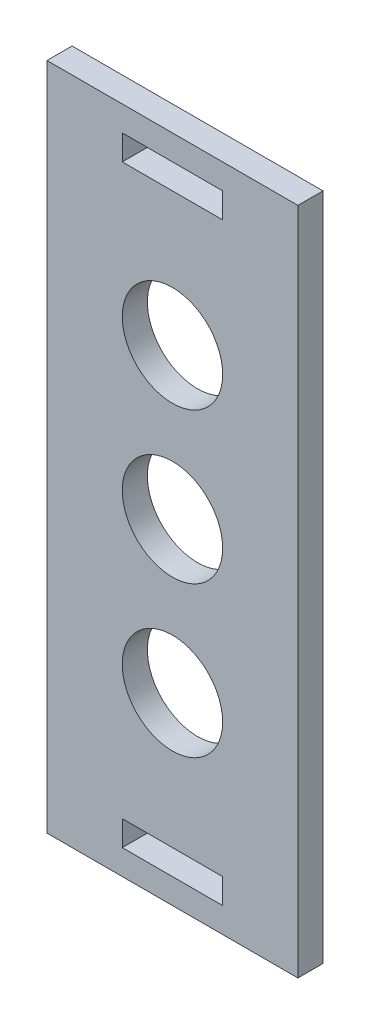
ISO-10303-21;
HEADER;
FILE_DESCRIPTION(('STEP AP214'),'2;1');
FILE_NAME('part.step','',(''),(''),'','','');
FILE_SCHEMA(('AUTOMOTIVE_DESIGN { 1 0 10303 214 1 1 1 1 }'));
ENDSEC;
DATA;
#1=APPLICATION_CONTEXT('core data for automotive mechanical design processes');
#2=APPLICATION_PROTOCOL_DEFINITION('international standard','automotive_design',2000,#1);
#3=PRODUCT_CONTEXT('',#1,'mechanical');
#4=PRODUCT('Part','Part','',(#3));
#5=PRODUCT_RELATED_PRODUCT_CATEGORY('part','',(#4));
#6=PRODUCT_DEFINITION_FORMATION('','',#4);
#7=PRODUCT_DEFINITION_CONTEXT('part definition',#1,'design');
#8=PRODUCT_DEFINITION('design','',#6,#7);
#9=PRODUCT_DEFINITION_SHAPE('','',#8);
#10=(LENGTH_UNIT() NAMED_UNIT(*) SI_UNIT(.MILLI.,.METRE.));
#11=(NAMED_UNIT(*) PLANE_ANGLE_UNIT() SI_UNIT($,.RADIAN.));
#12=(NAMED_UNIT(*) SI_UNIT($,.STERADIAN.) SOLID_ANGLE_UNIT());
#13=UNCERTAINTY_MEASURE_WITH_UNIT(LENGTH_MEASURE(1.E-05),#10,'distance_accuracy_value','');
#14=(GEOMETRIC_REPRESENTATION_CONTEXT(3) GLOBAL_UNCERTAINTY_ASSIGNED_CONTEXT((#13)) GLOBAL_UNIT_ASSIGNED_CONTEXT((#10,
#11,#12)) REPRESENTATION_CONTEXT('',''));
#15=CARTESIAN_POINT('',(0.,0.,0.));
#16=DIRECTION('',(0.,0.,1.));
#17=DIRECTION('',(1.,0.,0.));
#18=AXIS2_PLACEMENT_3D('',#15,#16,#17);
#19=CARTESIAN_POINT('',(0.,0.,3.));
#20=DIRECTION('',(0.,0.,-1.));
#21=DIRECTION('',(-1.,0.,0.));
#22=AXIS2_PLACEMENT_3D('',#19,#20,#21);
#23=PLANE('',#22);
#24=DIRECTION('',(0.,-1.,0.));
#25=VECTOR('',#24,1.);
#26=CARTESIAN_POINT('',(624.693975789222,317.419851643793,3.));
#27=LINE('',#26,#25);
#28=CARTESIAN_POINT('',(624.693975789222,317.419851643793,3.));
#29=VERTEX_POINT('',#28);
#30=CARTESIAN_POINT('',(624.693975789222,314.419851643793,3.));
#31=VERTEX_POINT('',#30);
#32=EDGE_CURVE('E163',#29,#31,#27,.T.);
#33=ORIENTED_EDGE('',*,*,#32,.F.);
#34=DIRECTION('',(-1.,0.,0.));
#35=VECTOR('',#34,1.);
#36=CARTESIAN_POINT('',(624.693975789222,317.419851643793,3.));
#37=LINE('',#36,#35);
#38=CARTESIAN_POINT('',(636.693975789222,317.419851643793,3.));
#39=VERTEX_POINT('',#38);
#40=EDGE_CURVE('E171',#39,#29,#37,.T.);
#41=ORIENTED_EDGE('',*,*,#40,.F.);
#42=DIRECTION('',(0.,1.,0.));
#43=VECTOR('',#42,1.);
#44=CARTESIAN_POINT('',(636.693975789222,317.419851643793,3.));
#45=LINE('',#44,#43);
#46=CARTESIAN_POINT('',(636.693975789222,314.419851643793,3.));
#47=VERTEX_POINT('',#46);
#48=EDGE_CURVE('E168',#47,#39,#45,.T.);
#49=ORIENTED_EDGE('',*,*,#48,.F.);
#50=DIRECTION('',(1.,0.,0.));
#51=VECTOR('',#50,1.);
#52=CARTESIAN_POINT('',(624.693975789222,314.419851643793,3.));
#53=LINE('',#52,#51);
#54=EDGE_CURVE('E165',#31,#47,#53,.T.);
#55=ORIENTED_EDGE('',*,*,#54,.F.);
#56=EDGE_LOOP('',(#33,#41,#49,#55));
#57=FACE_BOUND('',#56,.T.);
#58=DIRECTION('',(-1.,0.,0.));
#59=VECTOR('',#58,1.);
#60=CARTESIAN_POINT('',(615.693975789222,391.419851643793,3.));
#61=LINE('',#60,#59);
#62=CARTESIAN_POINT('',(645.693975789222,391.419851643793,3.));
#63=VERTEX_POINT('',#62);
#64=CARTESIAN_POINT('',(615.693975789222,391.419851643793,3.));
#65=VERTEX_POINT('',#64);
#66=EDGE_CURVE('E194',#63,#65,#61,.T.);
#67=ORIENTED_EDGE('',*,*,#66,.T.);
#68=DIRECTION('',(0.,-1.,0.));
#69=VECTOR('',#68,1.);
#70=CARTESIAN_POINT('',(615.693975789222,391.419851643793,3.));
#71=LINE('',#70,#69);
#72=CARTESIAN_POINT('',(615.693975789222,311.419851643793,3.));
#73=VERTEX_POINT('',#72);
#74=EDGE_CURVE('E197',#65,#73,#71,.T.);
#75=ORIENTED_EDGE('',*,*,#74,.T.);
#76=DIRECTION('',(1.,0.,0.));
#77=VECTOR('',#76,1.);
#78=CARTESIAN_POINT('',(615.693975789222,311.419851643793,3.));
#79=LINE('',#78,#77);
#80=CARTESIAN_POINT('',(645.693975789222,311.419851643793,3.));
#81=VERTEX_POINT('',#80);
#82=EDGE_CURVE('E200',#73,#81,#79,.T.);
#83=ORIENTED_EDGE('',*,*,#82,.T.);
#84=DIRECTION('',(0.,1.,0.));
#85=VECTOR('',#84,1.);
#86=CARTESIAN_POINT('',(645.693975789222,391.419851643793,3.));
#87=LINE('',#86,#85);
#88=EDGE_CURVE('E202',#81,#63,#87,.T.);
#89=ORIENTED_EDGE('',*,*,#88,.T.);
#90=EDGE_LOOP('',(#67,#75,#83,#89));
#91=FACE_BOUND('',#90,.T.);
#92=DIRECTION('',(0.,-1.,0.));
#93=VECTOR('',#92,1.);
#94=CARTESIAN_POINT('',(624.693975789222,388.419851643793,3.));
#95=LINE('',#94,#93);
#96=CARTESIAN_POINT('',(624.693975789222,388.419851643793,3.));
#97=VERTEX_POINT('',#96);
#98=CARTESIAN_POINT('',(624.693975789222,385.419851643793,3.));
#99=VERTEX_POINT('',#98);
#100=EDGE_CURVE('E124',#97,#99,#95,.T.);
#101=ORIENTED_EDGE('',*,*,#100,.F.);
#102=DIRECTION('',(-1.,0.,0.));
#103=VECTOR('',#102,1.);
#104=CARTESIAN_POINT('',(624.693975789222,388.419851643793,3.));
#105=LINE('',#104,#103);
#106=CARTESIAN_POINT('',(636.693975789222,388.419851643793,3.));
#107=VERTEX_POINT('',#106);
#108=EDGE_CURVE('E147',#107,#97,#105,.T.);
#109=ORIENTED_EDGE('',*,*,#108,.F.);
#110=DIRECTION('',(0.,1.,0.));
#111=VECTOR('',#110,1.);
#112=CARTESIAN_POINT('',(636.693975789222,388.419851643793,3.));
#113=LINE('',#112,#111);
#114=CARTESIAN_POINT('',(636.693975789222,385.419851643793,3.));
#115=VERTEX_POINT('',#114);
#116=EDGE_CURVE('E145',#115,#107,#113,.T.);
#117=ORIENTED_EDGE('',*,*,#116,.F.);
#118=DIRECTION('',(1.,0.,0.));
#119=VECTOR('',#118,1.);
#120=CARTESIAN_POINT('',(624.693975789222,385.419851643793,3.));
#121=LINE('',#120,#119);
#122=EDGE_CURVE('E132',#99,#115,#121,.T.);
#123=ORIENTED_EDGE('',*,*,#122,.F.);
#124=EDGE_LOOP('',(#101,#109,#117,#123));
#125=FACE_BOUND('',#124,.T.);
#126=CARTESIAN_POINT('',(630.693975789222,351.419851643793,3.));
#127=DIRECTION('',(0.,0.,1.));
#128=DIRECTION('',(1.,0.,0.));
#129=AXIS2_PLACEMENT_3D('',#126,#127,#128);
#130=CIRCLE('',#129,6.00000000000001);
#131=CARTESIAN_POINT('',(636.693975789222,351.419851643793,3.));
#132=VERTEX_POINT('',#131);
#133=EDGE_CURVE('E153',#132,#132,#130,.T.);
#134=ORIENTED_EDGE('',*,*,#133,.F.);
#135=EDGE_LOOP('',(#134));
#136=FACE_BOUND('',#135,.T.);
#137=CARTESIAN_POINT('',(630.693975789222,369.419851643793,3.));
#138=DIRECTION('',(0.,0.,1.));
#139=DIRECTION('',(1.,0.,0.));
#140=AXIS2_PLACEMENT_3D('',#137,#138,#139);
#141=CIRCLE('',#140,6.00000000000001);
#142=CARTESIAN_POINT('',(636.693975789222,369.419851643793,3.));
#143=VERTEX_POINT('',#142);
#144=EDGE_CURVE('E323',#143,#143,#141,.T.);
#145=ORIENTED_EDGE('',*,*,#144,.F.);
#146=EDGE_LOOP('',(#145));
#147=FACE_BOUND('',#146,.T.);
#148=CARTESIAN_POINT('',(630.693975789222,333.419851643793,3.));
#149=DIRECTION('',(0.,0.,1.));
#150=DIRECTION('',(1.,0.,0.));
#151=AXIS2_PLACEMENT_3D('',#148,#149,#150);
#152=CIRCLE('',#151,6.00000000000001);
#153=CARTESIAN_POINT('',(636.693975789222,333.419851643793,3.));
#154=VERTEX_POINT('',#153);
#155=EDGE_CURVE('E314',#154,#154,#152,.T.);
#156=ORIENTED_EDGE('',*,*,#155,.F.);
#157=EDGE_LOOP('',(#156));
#158=FACE_BOUND('',#157,.T.);
#159=ADVANCED_FACE('F35',(#57,#91,#125,#136,#147,#158),#23,.F.);
#160=CARTESIAN_POINT('',(0.,0.,0.));
#161=DIRECTION('',(0.,0.,-1.));
#162=DIRECTION('',(-1.,0.,0.));
#163=AXIS2_PLACEMENT_3D('',#160,#161,#162);
#164=PLANE('',#163);
#165=CARTESIAN_POINT('',(630.693975789222,369.419851643793,0.));
#166=DIRECTION('',(0.,0.,1.));
#167=DIRECTION('',(1.,0.,0.));
#168=AXIS2_PLACEMENT_3D('',#165,#166,#167);
#169=CIRCLE('',#168,6.00000000000001);
#170=CARTESIAN_POINT('',(636.693975789222,369.419851643793,0.));
#171=VERTEX_POINT('',#170);
#172=EDGE_CURVE('E320',#171,#171,#169,.T.);
#173=ORIENTED_EDGE('',*,*,#172,.T.);
#174=EDGE_LOOP('',(#173));
#175=FACE_BOUND('',#174,.T.);
#176=DIRECTION('',(-1.,0.,0.));
#177=VECTOR('',#176,1.);
#178=CARTESIAN_POINT('',(624.693975789222,388.419851643793,0.));
#179=LINE('',#178,#177);
#180=CARTESIAN_POINT('',(636.693975789222,388.419851643793,0.));
#181=VERTEX_POINT('',#180);
#182=CARTESIAN_POINT('',(624.693975789222,388.419851643793,0.));
#183=VERTEX_POINT('',#182);
#184=EDGE_CURVE('E133',#181,#183,#179,.T.);
#185=ORIENTED_EDGE('',*,*,#184,.T.);
#186=DIRECTION('',(0.,-1.,0.));
#187=VECTOR('',#186,1.);
#188=CARTESIAN_POINT('',(624.693975789222,388.419851643793,0.));
#189=LINE('',#188,#187);
#190=CARTESIAN_POINT('',(624.693975789222,385.419851643793,0.));
#191=VERTEX_POINT('',#190);
#192=EDGE_CURVE('E58',#183,#191,#189,.T.);
#193=ORIENTED_EDGE('',*,*,#192,.T.);
#194=DIRECTION('',(1.,0.,0.));
#195=VECTOR('',#194,1.);
#196=CARTESIAN_POINT('',(624.693975789222,385.419851643793,0.));
#197=LINE('',#196,#195);
#198=CARTESIAN_POINT('',(636.693975789222,385.419851643793,0.));
#199=VERTEX_POINT('',#198);
#200=EDGE_CURVE('E139',#191,#199,#197,.T.);
#201=ORIENTED_EDGE('',*,*,#200,.T.);
#202=DIRECTION('',(0.,1.,0.));
#203=VECTOR('',#202,1.);
#204=CARTESIAN_POINT('',(636.693975789222,388.419851643793,0.));
#205=LINE('',#204,#203);
#206=EDGE_CURVE('E155',#199,#181,#205,.T.);
#207=ORIENTED_EDGE('',*,*,#206,.T.);
#208=EDGE_LOOP('',(#185,#193,#201,#207));
#209=FACE_BOUND('',#208,.T.);
#210=DIRECTION('',(-1.,0.,0.));
#211=VECTOR('',#210,1.);
#212=CARTESIAN_POINT('',(624.693975789222,317.419851643793,0.));
#213=LINE('',#212,#211);
#214=CARTESIAN_POINT('',(636.693975789222,317.419851643793,0.));
#215=VERTEX_POINT('',#214);
#216=CARTESIAN_POINT('',(624.693975789222,317.419851643793,0.));
#217=VERTEX_POINT('',#216);
#218=EDGE_CURVE('E166',#215,#217,#213,.T.);
#219=ORIENTED_EDGE('',*,*,#218,.T.);
#220=DIRECTION('',(0.,-1.,0.));
#221=VECTOR('',#220,1.);
#222=CARTESIAN_POINT('',(624.693975789222,317.419851643793,0.));
#223=LINE('',#222,#221);
#224=CARTESIAN_POINT('',(624.693975789222,314.419851643793,0.));
#225=VERTEX_POINT('',#224);
#226=EDGE_CURVE('E140',#217,#225,#223,.T.);
#227=ORIENTED_EDGE('',*,*,#226,.T.);
#228=DIRECTION('',(1.,0.,0.));
#229=VECTOR('',#228,1.);
#230=CARTESIAN_POINT('',(624.693975789222,314.419851643793,0.));
#231=LINE('',#230,#229);
#232=CARTESIAN_POINT('',(636.693975789222,314.419851643793,0.));
#233=VERTEX_POINT('',#232);
#234=EDGE_CURVE('E176',#225,#233,#231,.T.);
#235=ORIENTED_EDGE('',*,*,#234,.T.);
#236=DIRECTION('',(0.,1.,0.));
#237=VECTOR('',#236,1.);
#238=CARTESIAN_POINT('',(636.693975789222,317.419851643793,0.));
#239=LINE('',#238,#237);
#240=EDGE_CURVE('E179',#233,#215,#239,.T.);
#241=ORIENTED_EDGE('',*,*,#240,.T.);
#242=EDGE_LOOP('',(#219,#227,#235,#241));
#243=FACE_BOUND('',#242,.T.);
#244=DIRECTION('',(-1.,0.,0.));
#245=VECTOR('',#244,1.);
#246=CARTESIAN_POINT('',(615.693975789222,391.419851643793,0.));
#247=LINE('',#246,#245);
#248=CARTESIAN_POINT('',(645.693975789222,391.419851643793,0.));
#249=VERTEX_POINT('',#248);
#250=CARTESIAN_POINT('',(615.693975789222,391.419851643793,0.));
#251=VERTEX_POINT('',#250);
#252=EDGE_CURVE('E193',#249,#251,#247,.T.);
#253=ORIENTED_EDGE('',*,*,#252,.F.);
#254=DIRECTION('',(0.,1.,0.));
#255=VECTOR('',#254,1.);
#256=CARTESIAN_POINT('',(645.693975789222,391.419851643793,0.));
#257=LINE('',#256,#255);
#258=CARTESIAN_POINT('',(645.693975789222,311.419851643793,0.));
#259=VERTEX_POINT('',#258);
#260=EDGE_CURVE('E198',#259,#249,#257,.T.);
#261=ORIENTED_EDGE('',*,*,#260,.F.);
#262=DIRECTION('',(1.,0.,0.));
#263=VECTOR('',#262,1.);
#264=CARTESIAN_POINT('',(615.693975789222,311.419851643793,0.));
#265=LINE('',#264,#263);
#266=CARTESIAN_POINT('',(615.693975789222,311.419851643793,0.));
#267=VERTEX_POINT('',#266);
#268=EDGE_CURVE('E209',#267,#259,#265,.T.);
#269=ORIENTED_EDGE('',*,*,#268,.F.);
#270=DIRECTION('',(0.,-1.,0.));
#271=VECTOR('',#270,1.);
#272=CARTESIAN_POINT('',(615.693975789222,391.419851643793,0.));
#273=LINE('',#272,#271);
#274=EDGE_CURVE('E207',#251,#267,#273,.T.);
#275=ORIENTED_EDGE('',*,*,#274,.F.);
#276=EDGE_LOOP('',(#253,#261,#269,#275));
#277=FACE_BOUND('',#276,.T.);
#278=CARTESIAN_POINT('',(630.693975789222,351.419851643793,0.));
#279=DIRECTION('',(0.,0.,1.));
#280=DIRECTION('',(1.,0.,0.));
#281=AXIS2_PLACEMENT_3D('',#278,#279,#280);
#282=CIRCLE('',#281,6.00000000000001);
#283=CARTESIAN_POINT('',(636.693975789222,351.419851643793,0.));
#284=VERTEX_POINT('',#283);
#285=EDGE_CURVE('E326',#284,#284,#282,.T.);
#286=ORIENTED_EDGE('',*,*,#285,.T.);
#287=EDGE_LOOP('',(#286));
#288=FACE_BOUND('',#287,.T.);
#289=CARTESIAN_POINT('',(630.693975789222,333.419851643793,0.));
#290=DIRECTION('',(0.,0.,1.));
#291=DIRECTION('',(1.,0.,0.));
#292=AXIS2_PLACEMENT_3D('',#289,#290,#291);
#293=CIRCLE('',#292,6.00000000000001);
#294=CARTESIAN_POINT('',(636.693975789222,333.419851643793,0.));
#295=VERTEX_POINT('',#294);
#296=EDGE_CURVE('E317',#295,#295,#293,.T.);
#297=ORIENTED_EDGE('',*,*,#296,.T.);
#298=EDGE_LOOP('',(#297));
#299=FACE_BOUND('',#298,.T.);
#300=ADVANCED_FACE('F227',(#175,#209,#243,#277,#288,#299),#164,.T.);
#301=CARTESIAN_POINT('',(615.693975789222,391.419851643793,3.));
#302=DIRECTION('',(0.,-1.,0.));
#303=DIRECTION('',(0.,0.,-1.));
#304=AXIS2_PLACEMENT_3D('',#301,#302,#303);
#305=PLANE('',#304);
#306=ORIENTED_EDGE('',*,*,#252,.T.);
#307=DIRECTION('',(0.,0.,-1.));
#308=VECTOR('',#307,1.);
#309=CARTESIAN_POINT('',(615.693975789222,391.419851643793,3.));
#310=LINE('',#309,#308);
#311=EDGE_CURVE('E11',#65,#251,#310,.T.);
#312=ORIENTED_EDGE('',*,*,#311,.F.);
#313=ORIENTED_EDGE('',*,*,#66,.F.);
#314=DIRECTION('',(0.,0.,-1.));
#315=VECTOR('',#314,1.);
#316=CARTESIAN_POINT('',(645.693975789222,391.419851643793,3.));
#317=LINE('',#316,#315);
#318=EDGE_CURVE('E204',#63,#249,#317,.T.);
#319=ORIENTED_EDGE('',*,*,#318,.T.);
#320=EDGE_LOOP('',(#306,#312,#313,#319));
#321=FACE_BOUND('',#320,.T.);
#322=ADVANCED_FACE('F37',(#321),#305,.F.);
#323=CARTESIAN_POINT('',(615.693975789222,391.419851643793,3.));
#324=DIRECTION('',(1.,0.,0.));
#325=DIRECTION('',(0.,1.,0.));
#326=AXIS2_PLACEMENT_3D('',#323,#324,#325);
#327=PLANE('',#326);
#328=ORIENTED_EDGE('',*,*,#274,.T.);
#329=DIRECTION('',(0.,0.,-1.));
#330=VECTOR('',#329,1.);
#331=CARTESIAN_POINT('',(615.693975789222,311.419851643793,3.));
#332=LINE('',#331,#330);
#333=EDGE_CURVE('E43',#73,#267,#332,.T.);
#334=ORIENTED_EDGE('',*,*,#333,.F.);
#335=ORIENTED_EDGE('',*,*,#74,.F.);
#336=ORIENTED_EDGE('',*,*,#311,.T.);
#337=EDGE_LOOP('',(#328,#334,#335,#336));
#338=FACE_BOUND('',#337,.T.);
#339=ADVANCED_FACE('F237',(#338),#327,.F.);
#340=CARTESIAN_POINT('',(615.693975789222,311.419851643793,3.));
#341=DIRECTION('',(0.,1.,0.));
#342=DIRECTION('',(0.,0.,1.));
#343=AXIS2_PLACEMENT_3D('',#340,#341,#342);
#344=PLANE('',#343);
#345=ORIENTED_EDGE('',*,*,#268,.T.);
#346=DIRECTION('',(0.,0.,-1.));
#347=VECTOR('',#346,1.);
#348=CARTESIAN_POINT('',(645.693975789222,311.419851643793,3.));
#349=LINE('',#348,#347);
#350=EDGE_CURVE('E214',#81,#259,#349,.T.);
#351=ORIENTED_EDGE('',*,*,#350,.F.);
#352=ORIENTED_EDGE('',*,*,#82,.F.);
#353=ORIENTED_EDGE('',*,*,#333,.T.);
#354=EDGE_LOOP('',(#345,#351,#352,#353));
#355=FACE_BOUND('',#354,.T.);
#356=ADVANCED_FACE('F221',(#355),#344,.F.);
#357=CARTESIAN_POINT('',(645.693975789222,391.419851643793,3.));
#358=DIRECTION('',(-1.,0.,0.));
#359=DIRECTION('',(0.,0.,1.));
#360=AXIS2_PLACEMENT_3D('',#357,#358,#359);
#361=PLANE('',#360);
#362=ORIENTED_EDGE('',*,*,#260,.T.);
#363=ORIENTED_EDGE('',*,*,#318,.F.);
#364=ORIENTED_EDGE('',*,*,#88,.F.);
#365=ORIENTED_EDGE('',*,*,#350,.T.);
#366=EDGE_LOOP('',(#362,#363,#364,#365));
#367=FACE_BOUND('',#366,.T.);
#368=ADVANCED_FACE('F231',(#367),#361,.F.);
#369=CARTESIAN_POINT('',(624.693975789222,317.419851643793,3.));
#370=DIRECTION('',(1.,0.,0.));
#371=DIRECTION('',(0.,1.,0.));
#372=AXIS2_PLACEMENT_3D('',#369,#370,#371);
#373=PLANE('',#372);
#374=ORIENTED_EDGE('',*,*,#226,.F.);
#375=DIRECTION('',(0.,0.,-1.));
#376=VECTOR('',#375,1.);
#377=CARTESIAN_POINT('',(624.693975789222,317.419851643793,3.));
#378=LINE('',#377,#376);
#379=EDGE_CURVE('E173',#29,#217,#378,.T.);
#380=ORIENTED_EDGE('',*,*,#379,.F.);
#381=ORIENTED_EDGE('',*,*,#32,.T.);
#382=DIRECTION('',(0.,0.,-1.));
#383=VECTOR('',#382,1.);
#384=CARTESIAN_POINT('',(624.693975789222,314.419851643793,3.));
#385=LINE('',#384,#383);
#386=EDGE_CURVE('E190',#31,#225,#385,.T.);
#387=ORIENTED_EDGE('',*,*,#386,.T.);
#388=EDGE_LOOP('',(#374,#380,#381,#387));
#389=FACE_BOUND('',#388,.T.);
#390=ADVANCED_FACE('F254',(#389),#373,.T.);
#391=CARTESIAN_POINT('',(624.693975789222,314.419851643793,3.));
#392=DIRECTION('',(0.,1.,0.));
#393=DIRECTION('',(0.,0.,1.));
#394=AXIS2_PLACEMENT_3D('',#391,#392,#393);
#395=PLANE('',#394);
#396=ORIENTED_EDGE('',*,*,#234,.F.);
#397=ORIENTED_EDGE('',*,*,#386,.F.);
#398=ORIENTED_EDGE('',*,*,#54,.T.);
#399=DIRECTION('',(0.,0.,-1.));
#400=VECTOR('',#399,1.);
#401=CARTESIAN_POINT('',(636.693975789222,314.419851643793,3.));
#402=LINE('',#401,#400);
#403=EDGE_CURVE('E188',#47,#233,#402,.T.);
#404=ORIENTED_EDGE('',*,*,#403,.T.);
#405=EDGE_LOOP('',(#396,#397,#398,#404));
#406=FACE_BOUND('',#405,.T.);
#407=ADVANCED_FACE('F261',(#406),#395,.T.);
#408=CARTESIAN_POINT('',(636.693975789222,317.419851643793,3.));
#409=DIRECTION('',(-1.,0.,0.));
#410=DIRECTION('',(0.,0.,1.));
#411=AXIS2_PLACEMENT_3D('',#408,#409,#410);
#412=PLANE('',#411);
#413=ORIENTED_EDGE('',*,*,#240,.F.);
#414=ORIENTED_EDGE('',*,*,#403,.F.);
#415=ORIENTED_EDGE('',*,*,#48,.T.);
#416=DIRECTION('',(0.,0.,-1.));
#417=VECTOR('',#416,1.);
#418=CARTESIAN_POINT('',(636.693975789222,317.419851643793,3.));
#419=LINE('',#418,#417);
#420=EDGE_CURVE('E186',#39,#215,#419,.T.);
#421=ORIENTED_EDGE('',*,*,#420,.T.);
#422=EDGE_LOOP('',(#413,#414,#415,#421));
#423=FACE_BOUND('',#422,.T.);
#424=ADVANCED_FACE('F266',(#423),#412,.T.);
#425=CARTESIAN_POINT('',(624.693975789222,317.419851643793,3.));
#426=DIRECTION('',(0.,-1.,0.));
#427=DIRECTION('',(0.,0.,-1.));
#428=AXIS2_PLACEMENT_3D('',#425,#426,#427);
#429=PLANE('',#428);
#430=ORIENTED_EDGE('',*,*,#218,.F.);
#431=ORIENTED_EDGE('',*,*,#420,.F.);
#432=ORIENTED_EDGE('',*,*,#40,.T.);
#433=ORIENTED_EDGE('',*,*,#379,.T.);
#434=EDGE_LOOP('',(#430,#431,#432,#433));
#435=FACE_BOUND('',#434,.T.);
#436=ADVANCED_FACE('F273',(#435),#429,.T.);
#437=CARTESIAN_POINT('',(624.693975789222,388.419851643793,3.));
#438=DIRECTION('',(1.,0.,0.));
#439=DIRECTION('',(0.,0.,-1.));
#440=AXIS2_PLACEMENT_3D('',#437,#438,#439);
#441=PLANE('',#440);
#442=ORIENTED_EDGE('',*,*,#192,.F.);
#443=DIRECTION('',(0.,0.,-1.));
#444=VECTOR('',#443,1.);
#445=CARTESIAN_POINT('',(624.693975789222,388.419851643793,3.));
#446=LINE('',#445,#444);
#447=EDGE_CURVE('E128',#97,#183,#446,.T.);
#448=ORIENTED_EDGE('',*,*,#447,.F.);
#449=ORIENTED_EDGE('',*,*,#100,.T.);
#450=DIRECTION('',(0.,0.,-1.));
#451=VECTOR('',#450,1.);
#452=CARTESIAN_POINT('',(624.693975789222,385.419851643793,3.));
#453=LINE('',#452,#451);
#454=EDGE_CURVE('E127',#99,#191,#453,.T.);
#455=ORIENTED_EDGE('',*,*,#454,.T.);
#456=EDGE_LOOP('',(#442,#448,#449,#455));
#457=FACE_BOUND('',#456,.T.);
#458=ADVANCED_FACE('F126',(#457),#441,.T.);
#459=CARTESIAN_POINT('',(624.693975789222,385.419851643793,3.));
#460=DIRECTION('',(0.,1.,0.));
#461=DIRECTION('',(0.,0.,1.));
#462=AXIS2_PLACEMENT_3D('',#459,#460,#461);
#463=PLANE('',#462);
#464=ORIENTED_EDGE('',*,*,#200,.F.);
#465=ORIENTED_EDGE('',*,*,#454,.F.);
#466=ORIENTED_EDGE('',*,*,#122,.T.);
#467=DIRECTION('',(0.,0.,-1.));
#468=VECTOR('',#467,1.);
#469=CARTESIAN_POINT('',(636.693975789222,385.419851643793,3.));
#470=LINE('',#469,#468);
#471=EDGE_CURVE('E141',#115,#199,#470,.T.);
#472=ORIENTED_EDGE('',*,*,#471,.T.);
#473=EDGE_LOOP('',(#464,#465,#466,#472));
#474=FACE_BOUND('',#473,.T.);
#475=ADVANCED_FACE('F136',(#474),#463,.T.);
#476=CARTESIAN_POINT('',(636.693975789222,388.419851643793,3.));
#477=DIRECTION('',(-1.,0.,0.));
#478=DIRECTION('',(0.,-1.,0.));
#479=AXIS2_PLACEMENT_3D('',#476,#477,#478);
#480=PLANE('',#479);
#481=ORIENTED_EDGE('',*,*,#206,.F.);
#482=ORIENTED_EDGE('',*,*,#471,.F.);
#483=ORIENTED_EDGE('',*,*,#116,.T.);
#484=DIRECTION('',(0.,0.,-1.));
#485=VECTOR('',#484,1.);
#486=CARTESIAN_POINT('',(636.693975789222,388.419851643793,3.));
#487=LINE('',#486,#485);
#488=EDGE_CURVE('E50',#107,#181,#487,.T.);
#489=ORIENTED_EDGE('',*,*,#488,.T.);
#490=EDGE_LOOP('',(#481,#482,#483,#489));
#491=FACE_BOUND('',#490,.T.);
#492=ADVANCED_FACE('F291',(#491),#480,.T.);
#493=CARTESIAN_POINT('',(624.693975789222,388.419851643793,3.));
#494=DIRECTION('',(0.,-1.,0.));
#495=DIRECTION('',(0.,0.,-1.));
#496=AXIS2_PLACEMENT_3D('',#493,#494,#495);
#497=PLANE('',#496);
#498=ORIENTED_EDGE('',*,*,#184,.F.);
#499=ORIENTED_EDGE('',*,*,#488,.F.);
#500=ORIENTED_EDGE('',*,*,#108,.T.);
#501=ORIENTED_EDGE('',*,*,#447,.T.);
#502=EDGE_LOOP('',(#498,#499,#500,#501));
#503=FACE_BOUND('',#502,.T.);
#504=ADVANCED_FACE('F294',(#503),#497,.T.);
#505=CARTESIAN_POINT('',(630.693975789222,351.419851643793,3.));
#506=DIRECTION('',(0.,0.,-1.));
#507=DIRECTION('',(-1.,0.,0.));
#508=AXIS2_PLACEMENT_3D('',#505,#506,#507);
#509=CYLINDRICAL_SURFACE('',#508,6.00000000000001);
#510=ORIENTED_EDGE('',*,*,#133,.T.);
#511=EDGE_LOOP('',(#510));
#512=FACE_BOUND('',#511,.T.);
#513=ORIENTED_EDGE('',*,*,#285,.F.);
#514=EDGE_LOOP('',(#513));
#515=FACE_BOUND('',#514,.T.);
#516=ADVANCED_FACE('F298',(#512,#515),#509,.F.);
#517=CARTESIAN_POINT('',(630.693975789222,369.419851643793,3.));
#518=DIRECTION('',(0.,0.,-1.));
#519=DIRECTION('',(-1.,0.,0.));
#520=AXIS2_PLACEMENT_3D('',#517,#518,#519);
#521=CYLINDRICAL_SURFACE('',#520,6.00000000000001);
#522=ORIENTED_EDGE('',*,*,#144,.T.);
#523=EDGE_LOOP('',(#522));
#524=FACE_BOUND('',#523,.T.);
#525=ORIENTED_EDGE('',*,*,#172,.F.);
#526=EDGE_LOOP('',(#525));
#527=FACE_BOUND('',#526,.T.);
#528=ADVANCED_FACE('F301',(#524,#527),#521,.F.);
#529=CARTESIAN_POINT('',(630.693975789222,333.419851643793,3.));
#530=DIRECTION('',(0.,0.,-1.));
#531=DIRECTION('',(-1.,0.,0.));
#532=AXIS2_PLACEMENT_3D('',#529,#530,#531);
#533=CYLINDRICAL_SURFACE('',#532,6.00000000000001);
#534=ORIENTED_EDGE('',*,*,#155,.T.);
#535=EDGE_LOOP('',(#534));
#536=FACE_BOUND('',#535,.T.);
#537=ORIENTED_EDGE('',*,*,#296,.F.);
#538=EDGE_LOOP('',(#537));
#539=FACE_BOUND('',#538,.T.);
#540=ADVANCED_FACE('F305',(#536,#539),#533,.F.);
#541=CLOSED_SHELL('',(#159,#300,#322,#339,#356,#368,#390,#407,#424,#436,#458,#475,#492,#504,
#516,#528,#540));
#542=MANIFOLD_SOLID_BREP('B2',#541);
#543=ADVANCED_BREP_SHAPE_REPRESENTATION('',(#18,#542),#14);
#544=SHAPE_DEFINITION_REPRESENTATION(#9,#543);
ENDSEC;
END-ISO-10303-21;
